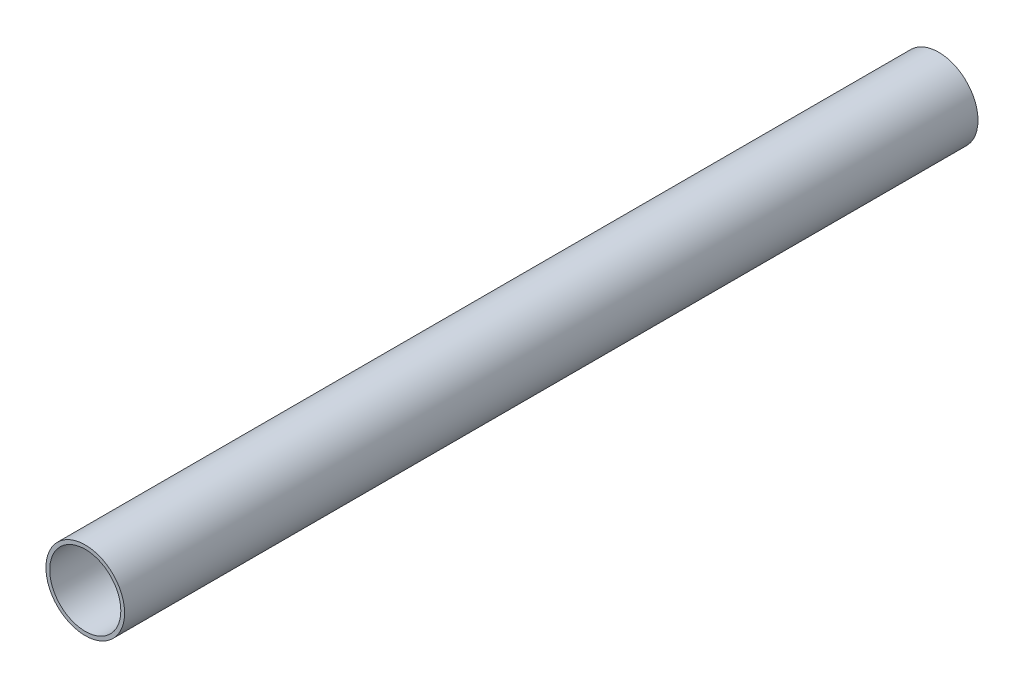
ISO-10303-21;
HEADER;
FILE_DESCRIPTION(('STEP AP214'),'2;1');
FILE_NAME('part.step','',(''),(''),'','','');
FILE_SCHEMA(('AUTOMOTIVE_DESIGN { 1 0 10303 214 1 1 1 1 }'));
ENDSEC;
DATA;
#1=APPLICATION_CONTEXT('core data for automotive mechanical design processes');
#2=APPLICATION_PROTOCOL_DEFINITION('international standard','automotive_design',2000,#1);
#3=PRODUCT_CONTEXT('',#1,'mechanical');
#4=PRODUCT('Part','Part','',(#3));
#5=PRODUCT_RELATED_PRODUCT_CATEGORY('part','',(#4));
#6=PRODUCT_DEFINITION_FORMATION('','',#4);
#7=PRODUCT_DEFINITION_CONTEXT('part definition',#1,'design');
#8=PRODUCT_DEFINITION('design','',#6,#7);
#9=PRODUCT_DEFINITION_SHAPE('','',#8);
#10=(LENGTH_UNIT() NAMED_UNIT(*) SI_UNIT(.MILLI.,.METRE.));
#11=(NAMED_UNIT(*) PLANE_ANGLE_UNIT() SI_UNIT($,.RADIAN.));
#12=(NAMED_UNIT(*) SI_UNIT($,.STERADIAN.) SOLID_ANGLE_UNIT());
#13=UNCERTAINTY_MEASURE_WITH_UNIT(LENGTH_MEASURE(1.E-05),#10,'distance_accuracy_value','');
#14=(GEOMETRIC_REPRESENTATION_CONTEXT(3) GLOBAL_UNCERTAINTY_ASSIGNED_CONTEXT((#13)) GLOBAL_UNIT_ASSIGNED_CONTEXT((#10,
#11,#12)) REPRESENTATION_CONTEXT('',''));
#15=CARTESIAN_POINT('',(0.,0.,0.));
#16=DIRECTION('',(0.,0.,1.));
#17=DIRECTION('',(1.,0.,0.));
#18=AXIS2_PLACEMENT_3D('',#15,#16,#17);
#19=CARTESIAN_POINT('',(0.,0.,152.4));
#20=DIRECTION('',(0.,0.,1.));
#21=DIRECTION('',(1.,0.,0.));
#22=AXIS2_PLACEMENT_3D('',#19,#20,#21);
#23=PLANE('',#22);
#24=CARTESIAN_POINT('',(0.,0.,152.4));
#25=DIRECTION('',(0.,0.,1.));
#26=DIRECTION('',(1.,0.,0.));
#27=AXIS2_PLACEMENT_3D('',#24,#25,#26);
#28=CIRCLE('',#27,14.0462);
#29=CARTESIAN_POINT('',(14.0462,0.,152.4));
#30=VERTEX_POINT('',#29);
#31=EDGE_CURVE('E11',#30,#30,#28,.T.);
#32=ORIENTED_EDGE('',*,*,#31,.T.);
#33=EDGE_LOOP('',(#32));
#34=FACE_BOUND('',#33,.T.);
#35=CARTESIAN_POINT('',(0.,0.,152.4));
#36=DIRECTION('',(0.,0.,1.));
#37=DIRECTION('',(1.,0.,0.));
#38=AXIS2_PLACEMENT_3D('',#35,#36,#37);
#39=CIRCLE('',#38,12.7);
#40=CARTESIAN_POINT('',(12.7,0.,152.4));
#41=VERTEX_POINT('',#40);
#42=EDGE_CURVE('E47',#41,#41,#39,.T.);
#43=ORIENTED_EDGE('',*,*,#42,.F.);
#44=EDGE_LOOP('',(#43));
#45=FACE_BOUND('',#44,.T.);
#46=ADVANCED_FACE('F36',(#34,#45),#23,.T.);
#47=CARTESIAN_POINT('',(0.,0.,-152.4));
#48=DIRECTION('',(0.,0.,1.));
#49=DIRECTION('',(1.,0.,0.));
#50=AXIS2_PLACEMENT_3D('',#47,#48,#49);
#51=PLANE('',#50);
#52=CARTESIAN_POINT('',(0.,0.,-152.4));
#53=DIRECTION('',(0.,0.,1.));
#54=DIRECTION('',(1.,0.,0.));
#55=AXIS2_PLACEMENT_3D('',#52,#53,#54);
#56=CIRCLE('',#55,14.0462);
#57=CARTESIAN_POINT('',(14.0462,0.,-152.4));
#58=VERTEX_POINT('',#57);
#59=EDGE_CURVE('E40',#58,#58,#56,.T.);
#60=ORIENTED_EDGE('',*,*,#59,.F.);
#61=EDGE_LOOP('',(#60));
#62=FACE_BOUND('',#61,.T.);
#63=CARTESIAN_POINT('',(0.,0.,-152.4));
#64=DIRECTION('',(0.,0.,1.));
#65=DIRECTION('',(1.,0.,0.));
#66=AXIS2_PLACEMENT_3D('',#63,#64,#65);
#67=CIRCLE('',#66,12.7);
#68=CARTESIAN_POINT('',(12.7,0.,-152.4));
#69=VERTEX_POINT('',#68);
#70=EDGE_CURVE('E49',#69,#69,#67,.T.);
#71=ORIENTED_EDGE('',*,*,#70,.T.);
#72=EDGE_LOOP('',(#71));
#73=FACE_BOUND('',#72,.T.);
#74=ADVANCED_FACE('F59',(#62,#73),#51,.F.);
#75=CARTESIAN_POINT('',(0.,0.,152.4));
#76=DIRECTION('',(0.,0.,-1.));
#77=DIRECTION('',(-1.,0.,0.));
#78=AXIS2_PLACEMENT_3D('',#75,#76,#77);
#79=CYLINDRICAL_SURFACE('',#78,14.0462);
#80=ORIENTED_EDGE('',*,*,#31,.F.);
#81=EDGE_LOOP('',(#80));
#82=FACE_BOUND('',#81,.T.);
#83=ORIENTED_EDGE('',*,*,#59,.T.);
#84=EDGE_LOOP('',(#83));
#85=FACE_BOUND('',#84,.T.);
#86=ADVANCED_FACE('F38',(#82,#85),#79,.T.);
#87=CARTESIAN_POINT('',(0.,0.,152.4));
#88=DIRECTION('',(0.,0.,-1.));
#89=DIRECTION('',(-1.,0.,0.));
#90=AXIS2_PLACEMENT_3D('',#87,#88,#89);
#91=CYLINDRICAL_SURFACE('',#90,12.7);
#92=ORIENTED_EDGE('',*,*,#42,.T.);
#93=EDGE_LOOP('',(#92));
#94=FACE_BOUND('',#93,.T.);
#95=ORIENTED_EDGE('',*,*,#70,.F.);
#96=EDGE_LOOP('',(#95));
#97=FACE_BOUND('',#96,.T.);
#98=ADVANCED_FACE('F55',(#94,#97),#91,.F.);
#99=CLOSED_SHELL('',(#46,#74,#86,#98));
#100=MANIFOLD_SOLID_BREP('B2',#99);
#101=ADVANCED_BREP_SHAPE_REPRESENTATION('',(#18,#100),#14);
#102=SHAPE_DEFINITION_REPRESENTATION(#9,#101);
ENDSEC;
END-ISO-10303-21;
